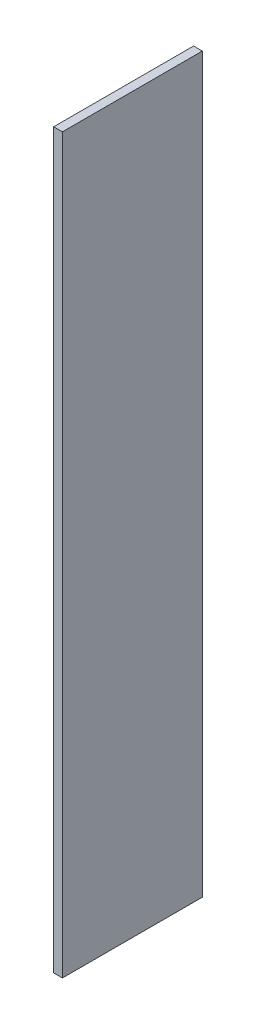
ISO-10303-21;
HEADER;
FILE_DESCRIPTION(('STEP AP214'),'2;1');
FILE_NAME('part.step','',(''),(''),'','','');
FILE_SCHEMA(('AUTOMOTIVE_DESIGN { 1 0 10303 214 1 1 1 1 }'));
ENDSEC;
DATA;
#1=APPLICATION_CONTEXT('core data for automotive mechanical design processes');
#2=APPLICATION_PROTOCOL_DEFINITION('international standard','automotive_design',2000,#1);
#3=PRODUCT_CONTEXT('',#1,'mechanical');
#4=PRODUCT('Part','Part','',(#3));
#5=PRODUCT_RELATED_PRODUCT_CATEGORY('part','',(#4));
#6=PRODUCT_DEFINITION_FORMATION('','',#4);
#7=PRODUCT_DEFINITION_CONTEXT('part definition',#1,'design');
#8=PRODUCT_DEFINITION('design','',#6,#7);
#9=PRODUCT_DEFINITION_SHAPE('','',#8);
#10=(LENGTH_UNIT() NAMED_UNIT(*) SI_UNIT(.MILLI.,.METRE.));
#11=(NAMED_UNIT(*) PLANE_ANGLE_UNIT() SI_UNIT($,.RADIAN.));
#12=(NAMED_UNIT(*) SI_UNIT($,.STERADIAN.) SOLID_ANGLE_UNIT());
#13=UNCERTAINTY_MEASURE_WITH_UNIT(LENGTH_MEASURE(1.E-05),#10,'distance_accuracy_value','');
#14=(GEOMETRIC_REPRESENTATION_CONTEXT(3) GLOBAL_UNCERTAINTY_ASSIGNED_CONTEXT((#13)) GLOBAL_UNIT_ASSIGNED_CONTEXT((#10,
#11,#12)) REPRESENTATION_CONTEXT('',''));
#15=CARTESIAN_POINT('',(0.,0.,0.));
#16=DIRECTION('',(0.,0.,1.));
#17=DIRECTION('',(1.,0.,0.));
#18=AXIS2_PLACEMENT_3D('',#15,#16,#17);
#19=CARTESIAN_POINT('',(0.,-532.13,101.6));
#20=DIRECTION('',(1.,0.,0.));
#21=DIRECTION('',(0.,0.,-1.));
#22=AXIS2_PLACEMENT_3D('',#19,#20,#21);
#23=PLANE('',#22);
#24=DIRECTION('',(0.,-1.,0.));
#25=VECTOR('',#24,1.);
#26=CARTESIAN_POINT('',(0.,-532.13,0.));
#27=LINE('',#26,#25);
#28=CARTESIAN_POINT('',(0.,0.,0.));
#29=VERTEX_POINT('',#28);
#30=CARTESIAN_POINT('',(0.,-532.13,0.));
#31=VERTEX_POINT('',#30);
#32=EDGE_CURVE('E113',#29,#31,#27,.T.);
#33=ORIENTED_EDGE('',*,*,#32,.T.);
#34=DIRECTION('',(0.,0.,-1.));
#35=VECTOR('',#34,1.);
#36=CARTESIAN_POINT('',(0.,-532.13,101.6));
#37=LINE('',#36,#35);
#38=CARTESIAN_POINT('',(0.,-532.13,101.6));
#39=VERTEX_POINT('',#38);
#40=EDGE_CURVE('E11',#39,#31,#37,.T.);
#41=ORIENTED_EDGE('',*,*,#40,.F.);
#42=DIRECTION('',(0.,-1.,0.));
#43=VECTOR('',#42,1.);
#44=CARTESIAN_POINT('',(0.,-532.13,101.6));
#45=LINE('',#44,#43);
#46=CARTESIAN_POINT('',(0.,0.,101.6));
#47=VERTEX_POINT('',#46);
#48=EDGE_CURVE('E97',#47,#39,#45,.T.);
#49=ORIENTED_EDGE('',*,*,#48,.F.);
#50=DIRECTION('',(0.,0.,-1.));
#51=VECTOR('',#50,1.);
#52=CARTESIAN_POINT('',(0.,0.,101.6));
#53=LINE('',#52,#51);
#54=EDGE_CURVE('E109',#47,#29,#53,.T.);
#55=ORIENTED_EDGE('',*,*,#54,.T.);
#56=EDGE_LOOP('',(#33,#41,#49,#55));
#57=FACE_BOUND('',#56,.T.);
#58=ADVANCED_FACE('F45',(#57),#23,.F.);
#59=CARTESIAN_POINT('',(6.35000000000006,-532.13,101.6));
#60=DIRECTION('',(0.,1.,0.));
#61=DIRECTION('',(0.,0.,1.));
#62=AXIS2_PLACEMENT_3D('',#59,#60,#61);
#63=PLANE('',#62);
#64=DIRECTION('',(1.,0.,0.));
#65=VECTOR('',#64,1.);
#66=CARTESIAN_POINT('',(6.35000000000006,-532.13,0.));
#67=LINE('',#66,#65);
#68=CARTESIAN_POINT('',(6.35000000000006,-532.13,0.));
#69=VERTEX_POINT('',#68);
#70=EDGE_CURVE('E102',#31,#69,#67,.T.);
#71=ORIENTED_EDGE('',*,*,#70,.T.);
#72=DIRECTION('',(0.,0.,-1.));
#73=VECTOR('',#72,1.);
#74=CARTESIAN_POINT('',(6.35000000000006,-532.13,101.6));
#75=LINE('',#74,#73);
#76=CARTESIAN_POINT('',(6.35000000000006,-532.13,101.6));
#77=VERTEX_POINT('',#76);
#78=EDGE_CURVE('E54',#77,#69,#75,.T.);
#79=ORIENTED_EDGE('',*,*,#78,.F.);
#80=DIRECTION('',(1.,0.,0.));
#81=VECTOR('',#80,1.);
#82=CARTESIAN_POINT('',(6.35000000000006,-532.13,101.6));
#83=LINE('',#82,#81);
#84=EDGE_CURVE('E92',#39,#77,#83,.T.);
#85=ORIENTED_EDGE('',*,*,#84,.F.);
#86=ORIENTED_EDGE('',*,*,#40,.T.);
#87=EDGE_LOOP('',(#71,#79,#85,#86));
#88=FACE_BOUND('',#87,.T.);
#89=ADVANCED_FACE('F101',(#88),#63,.F.);
#90=CARTESIAN_POINT('',(6.35,0.,101.6));
#91=DIRECTION('',(-1.,0.,0.));
#92=DIRECTION('',(0.,-1.,0.));
#93=AXIS2_PLACEMENT_3D('',#90,#91,#92);
#94=PLANE('',#93);
#95=DIRECTION('',(0.,1.,0.));
#96=VECTOR('',#95,1.);
#97=CARTESIAN_POINT('',(6.35,0.,0.));
#98=LINE('',#97,#96);
#99=CARTESIAN_POINT('',(6.35,0.,0.));
#100=VERTEX_POINT('',#99);
#101=EDGE_CURVE('E79',#69,#100,#98,.T.);
#102=ORIENTED_EDGE('',*,*,#101,.T.);
#103=DIRECTION('',(0.,0.,-1.));
#104=VECTOR('',#103,1.);
#105=CARTESIAN_POINT('',(6.35,0.,101.6));
#106=LINE('',#105,#104);
#107=CARTESIAN_POINT('',(6.35,0.,101.6));
#108=VERTEX_POINT('',#107);
#109=EDGE_CURVE('E104',#108,#100,#106,.T.);
#110=ORIENTED_EDGE('',*,*,#109,.F.);
#111=DIRECTION('',(0.,1.,0.));
#112=VECTOR('',#111,1.);
#113=CARTESIAN_POINT('',(6.35,0.,101.6));
#114=LINE('',#113,#112);
#115=EDGE_CURVE('E95',#77,#108,#114,.T.);
#116=ORIENTED_EDGE('',*,*,#115,.F.);
#117=ORIENTED_EDGE('',*,*,#78,.T.);
#118=EDGE_LOOP('',(#102,#110,#116,#117));
#119=FACE_BOUND('',#118,.T.);
#120=ADVANCED_FACE('F105',(#119),#94,.F.);
#121=CARTESIAN_POINT('',(0.,0.,101.6));
#122=DIRECTION('',(0.,-1.,0.));
#123=DIRECTION('',(0.,0.,-1.));
#124=AXIS2_PLACEMENT_3D('',#121,#122,#123);
#125=PLANE('',#124);
#126=DIRECTION('',(-1.,0.,0.));
#127=VECTOR('',#126,1.);
#128=CARTESIAN_POINT('',(0.,0.,0.));
#129=LINE('',#128,#127);
#130=EDGE_CURVE('E85',#100,#29,#129,.T.);
#131=ORIENTED_EDGE('',*,*,#130,.T.);
#132=ORIENTED_EDGE('',*,*,#54,.F.);
#133=DIRECTION('',(-1.,0.,0.));
#134=VECTOR('',#133,1.);
#135=CARTESIAN_POINT('',(0.,0.,101.6));
#136=LINE('',#135,#134);
#137=EDGE_CURVE('E62',#108,#47,#136,.T.);
#138=ORIENTED_EDGE('',*,*,#137,.F.);
#139=ORIENTED_EDGE('',*,*,#109,.T.);
#140=EDGE_LOOP('',(#131,#132,#138,#139));
#141=FACE_BOUND('',#140,.T.);
#142=ADVANCED_FACE('F126',(#141),#125,.F.);
#143=CARTESIAN_POINT('',(0.,0.,101.6));
#144=DIRECTION('',(0.,0.,-1.));
#145=DIRECTION('',(-1.,0.,0.));
#146=AXIS2_PLACEMENT_3D('',#143,#144,#145);
#147=PLANE('',#146);
#148=ORIENTED_EDGE('',*,*,#48,.T.);
#149=ORIENTED_EDGE('',*,*,#84,.T.);
#150=ORIENTED_EDGE('',*,*,#115,.T.);
#151=ORIENTED_EDGE('',*,*,#137,.T.);
#152=EDGE_LOOP('',(#148,#149,#150,#151));
#153=FACE_BOUND('',#152,.T.);
#154=ADVANCED_FACE('F93',(#153),#147,.F.);
#155=CARTESIAN_POINT('',(0.,0.,0.));
#156=DIRECTION('',(0.,0.,-1.));
#157=DIRECTION('',(-1.,0.,0.));
#158=AXIS2_PLACEMENT_3D('',#155,#156,#157);
#159=PLANE('',#158);
#160=ORIENTED_EDGE('',*,*,#32,.F.);
#161=ORIENTED_EDGE('',*,*,#130,.F.);
#162=ORIENTED_EDGE('',*,*,#101,.F.);
#163=ORIENTED_EDGE('',*,*,#70,.F.);
#164=EDGE_LOOP('',(#160,#161,#162,#163));
#165=FACE_BOUND('',#164,.T.);
#166=ADVANCED_FACE('F129',(#165),#159,.T.);
#167=CLOSED_SHELL('',(#58,#89,#120,#142,#154,#166));
#168=MANIFOLD_SOLID_BREP('B2',#167);
#169=ADVANCED_BREP_SHAPE_REPRESENTATION('',(#18,#168),#14);
#170=SHAPE_DEFINITION_REPRESENTATION(#9,#169);
ENDSEC;
END-ISO-10303-21;
